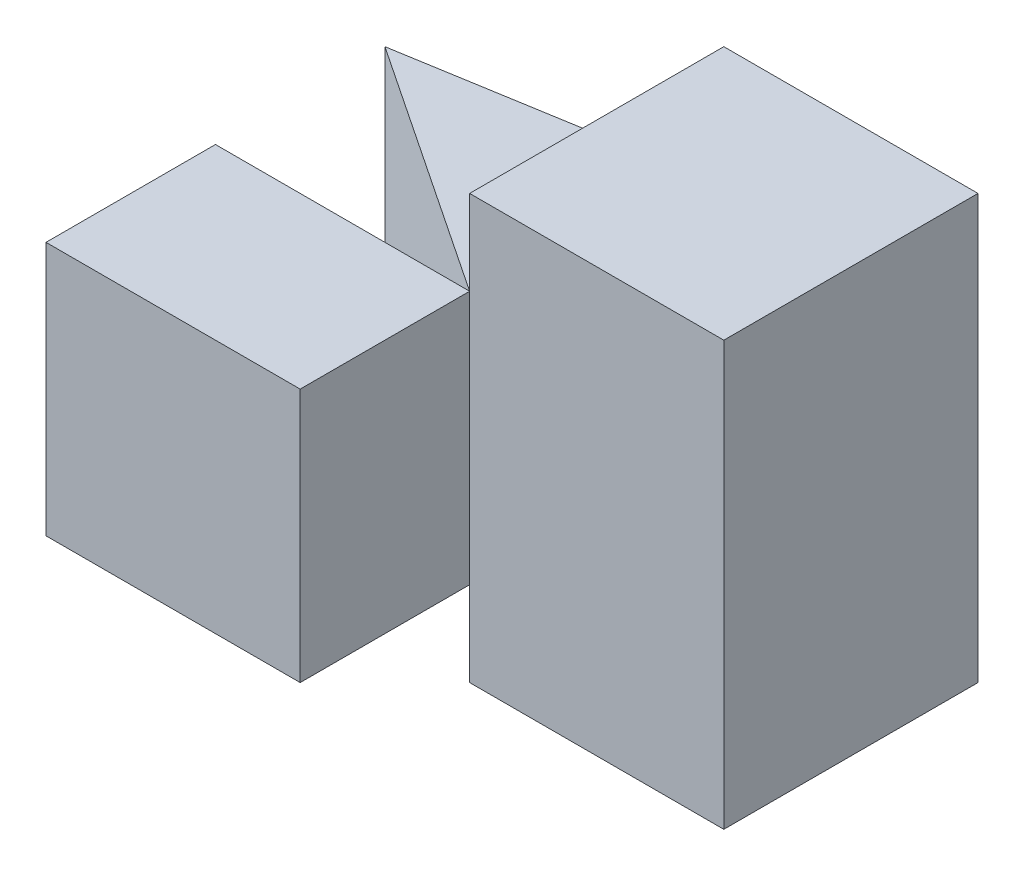
ISO-10303-21;
HEADER;
FILE_DESCRIPTION(('STEP AP214'),'2;1');
FILE_NAME('part.step','',(''),(''),'','','');
FILE_SCHEMA(('AUTOMOTIVE_DESIGN { 1 0 10303 214 1 1 1 1 }'));
ENDSEC;
DATA;
#1=APPLICATION_CONTEXT('core data for automotive mechanical design processes');
#2=APPLICATION_PROTOCOL_DEFINITION('international standard','automotive_design',2000,#1);
#3=PRODUCT_CONTEXT('',#1,'mechanical');
#4=PRODUCT('Part','Part','',(#3));
#5=PRODUCT_RELATED_PRODUCT_CATEGORY('part','',(#4));
#6=PRODUCT_DEFINITION_FORMATION('','',#4);
#7=PRODUCT_DEFINITION_CONTEXT('part definition',#1,'design');
#8=PRODUCT_DEFINITION('design','',#6,#7);
#9=PRODUCT_DEFINITION_SHAPE('','',#8);
#10=(LENGTH_UNIT() NAMED_UNIT(*) SI_UNIT(.MILLI.,.METRE.));
#11=(NAMED_UNIT(*) PLANE_ANGLE_UNIT() SI_UNIT($,.RADIAN.));
#12=(NAMED_UNIT(*) SI_UNIT($,.STERADIAN.) SOLID_ANGLE_UNIT());
#13=UNCERTAINTY_MEASURE_WITH_UNIT(LENGTH_MEASURE(1.E-05),#10,'distance_accuracy_value','');
#14=(GEOMETRIC_REPRESENTATION_CONTEXT(3) GLOBAL_UNCERTAINTY_ASSIGNED_CONTEXT((#13)) GLOBAL_UNIT_ASSIGNED_CONTEXT((#10,
#11,#12)) REPRESENTATION_CONTEXT('',''));
#15=CARTESIAN_POINT('',(0.,0.,0.));
#16=DIRECTION('',(0.,0.,1.));
#17=DIRECTION('',(1.,0.,0.));
#18=AXIS2_PLACEMENT_3D('',#15,#16,#17);
#19=CARTESIAN_POINT('',(0.,5.,-5.));
#20=DIRECTION('',(0.,0.,-1.));
#21=DIRECTION('',(-1.,0.,0.));
#22=AXIS2_PLACEMENT_3D('',#19,#20,#21);
#23=PLANE('',#22);
#24=DIRECTION('',(-1.,0.,0.));
#25=VECTOR('',#24,1.);
#26=CARTESIAN_POINT('',(0.,1.,-5.));
#27=LINE('',#26,#25);
#28=CARTESIAN_POINT('',(6.,1.,-5.));
#29=VERTEX_POINT('',#28);
#30=CARTESIAN_POINT('',(3.,1.,-5.));
#31=VERTEX_POINT('',#30);
#32=EDGE_CURVE('E141',#29,#31,#27,.T.);
#33=ORIENTED_EDGE('',*,*,#32,.F.);
#34=DIRECTION('',(0.,-1.,0.));
#35=VECTOR('',#34,1.);
#36=CARTESIAN_POINT('',(6.,5.,-5.));
#37=LINE('',#36,#35);
#38=CARTESIAN_POINT('',(6.,0.,-5.));
#39=VERTEX_POINT('',#38);
#40=EDGE_CURVE('E80',#29,#39,#37,.T.);
#41=ORIENTED_EDGE('',*,*,#40,.T.);
#42=DIRECTION('',(1.,0.,0.));
#43=VECTOR('',#42,1.);
#44=CARTESIAN_POINT('',(0.,0.,-5.));
#45=LINE('',#44,#43);
#46=CARTESIAN_POINT('',(3.,0.,-5.));
#47=VERTEX_POINT('',#46);
#48=EDGE_CURVE('E174',#47,#39,#45,.T.);
#49=ORIENTED_EDGE('',*,*,#48,.F.);
#50=DIRECTION('',(0.,1.,0.));
#51=VECTOR('',#50,1.);
#52=CARTESIAN_POINT('',(3.,1.,-5.));
#53=LINE('',#52,#51);
#54=EDGE_CURVE('E87',#47,#31,#53,.T.);
#55=ORIENTED_EDGE('',*,*,#54,.T.);
#56=EDGE_LOOP('',(#33,#41,#49,#55));
#57=FACE_BOUND('',#56,.T.);
#58=ADVANCED_FACE('F46',(#57),#23,.T.);
#59=CARTESIAN_POINT('',(3.,1.,-5.));
#60=DIRECTION('',(0.,1.,0.));
#61=DIRECTION('',(0.,0.,1.));
#62=AXIS2_PLACEMENT_3D('',#59,#60,#61);
#63=PLANE('',#62);
#64=DIRECTION('',(-0.986393923832144,0.,0.164398987305357));
#65=VECTOR('',#64,1.);
#66=CARTESIAN_POINT('',(6.,1.,-5.));
#67=LINE('',#66,#65);
#68=CARTESIAN_POINT('',(3.,1.,-4.5));
#69=VERTEX_POINT('',#68);
#70=CARTESIAN_POINT('',(0.,1.,-4.));
#71=VERTEX_POINT('',#70);
#72=EDGE_CURVE('E204',#69,#71,#67,.T.);
#73=ORIENTED_EDGE('',*,*,#72,.F.);
#74=DIRECTION('',(0.,0.,1.));
#75=VECTOR('',#74,1.);
#76=CARTESIAN_POINT('',(3.,1.,-5.));
#77=LINE('',#76,#75);
#78=CARTESIAN_POINT('',(3.,1.,-2.));
#79=VERTEX_POINT('',#78);
#80=EDGE_CURVE('E192',#69,#79,#77,.T.);
#81=ORIENTED_EDGE('',*,*,#80,.T.);
#82=DIRECTION('',(-0.832050294337844,0.,-0.554700196225229));
#83=VECTOR('',#82,1.);
#84=CARTESIAN_POINT('',(1.84615384615385,1.,-2.76923076923077));
#85=LINE('',#84,#83);
#86=EDGE_CURVE('E56',#79,#71,#85,.T.);
#87=ORIENTED_EDGE('',*,*,#86,.T.);
#88=EDGE_LOOP('',(#73,#81,#87));
#89=FACE_BOUND('',#88,.T.);
#90=ADVANCED_FACE('F221',(#89),#63,.F.);
#91=CARTESIAN_POINT('',(0.,4.,-5.));
#92=DIRECTION('',(0.,-1.,0.));
#93=DIRECTION('',(0.,0.,-1.));
#94=AXIS2_PLACEMENT_3D('',#91,#92,#93);
#95=PLANE('',#94);
#96=DIRECTION('',(0.986393923832144,0.,-0.164398987305357));
#97=VECTOR('',#96,1.);
#98=CARTESIAN_POINT('',(0.,4.,-4.));
#99=LINE('',#98,#97);
#100=CARTESIAN_POINT('',(0.,4.,-4.));
#101=VERTEX_POINT('',#100);
#102=CARTESIAN_POINT('',(3.,4.,-4.5));
#103=VERTEX_POINT('',#102);
#104=EDGE_CURVE('E142',#101,#103,#99,.T.);
#105=ORIENTED_EDGE('',*,*,#104,.F.);
#106=DIRECTION('',(0.832050294337844,0.,0.554700196225229));
#107=VECTOR('',#106,1.);
#108=CARTESIAN_POINT('',(1.84615384615385,4.,-2.76923076923077));
#109=LINE('',#108,#107);
#110=CARTESIAN_POINT('',(3.,4.,-2.));
#111=VERTEX_POINT('',#110);
#112=EDGE_CURVE('E13',#101,#111,#109,.T.);
#113=ORIENTED_EDGE('',*,*,#112,.T.);
#114=DIRECTION('',(0.,0.,1.));
#115=VECTOR('',#114,1.);
#116=CARTESIAN_POINT('',(3.,4.,-5.));
#117=LINE('',#116,#115);
#118=EDGE_CURVE('E194',#103,#111,#117,.T.);
#119=ORIENTED_EDGE('',*,*,#118,.F.);
#120=EDGE_LOOP('',(#105,#113,#119));
#121=FACE_BOUND('',#120,.T.);
#122=ADVANCED_FACE('F243',(#121),#95,.F.);
#123=CARTESIAN_POINT('',(1.84615384615385,5.,-2.76923076923077));
#124=DIRECTION('',(-0.554700196225229,0.,0.832050294337844));
#125=DIRECTION('',(0.832050294337844,0.,0.554700196225229));
#126=AXIS2_PLACEMENT_3D('',#123,#124,#125);
#127=PLANE('',#126);
#128=ORIENTED_EDGE('',*,*,#112,.F.);
#129=DIRECTION('',(0.,-1.,0.));
#130=VECTOR('',#129,1.);
#131=CARTESIAN_POINT('',(0.,5.,-4.));
#132=LINE('',#131,#130);
#133=EDGE_CURVE('E217',#101,#71,#132,.T.);
#134=ORIENTED_EDGE('',*,*,#133,.T.);
#135=ORIENTED_EDGE('',*,*,#86,.F.);
#136=DIRECTION('',(0.,-1.,0.));
#137=VECTOR('',#136,1.);
#138=CARTESIAN_POINT('',(3.,5.,-2.));
#139=LINE('',#138,#137);
#140=EDGE_CURVE('E164',#111,#79,#139,.T.);
#141=ORIENTED_EDGE('',*,*,#140,.F.);
#142=EDGE_LOOP('',(#128,#134,#135,#141));
#143=FACE_BOUND('',#142,.T.);
#144=ADVANCED_FACE('F48',(#143),#127,.T.);
#145=CARTESIAN_POINT('',(0.,5.,-2.));
#146=DIRECTION('',(0.,0.,-1.));
#147=DIRECTION('',(-1.,0.,0.));
#148=AXIS2_PLACEMENT_3D('',#145,#146,#147);
#149=PLANE('',#148);
#150=DIRECTION('',(1.,0.,0.));
#151=VECTOR('',#150,1.);
#152=CARTESIAN_POINT('',(0.,0.,-2.));
#153=LINE('',#152,#151);
#154=CARTESIAN_POINT('',(3.,0.,-2.));
#155=VERTEX_POINT('',#154);
#156=CARTESIAN_POINT('',(6.,0.,-2.));
#157=VERTEX_POINT('',#156);
#158=EDGE_CURVE('E180',#155,#157,#153,.T.);
#159=ORIENTED_EDGE('',*,*,#158,.T.);
#160=DIRECTION('',(0.,-1.,0.));
#161=VECTOR('',#160,1.);
#162=CARTESIAN_POINT('',(6.,5.,-2.));
#163=LINE('',#162,#161);
#164=CARTESIAN_POINT('',(6.,5.,-2.));
#165=VERTEX_POINT('',#164);
#166=EDGE_CURVE('E161',#165,#157,#163,.T.);
#167=ORIENTED_EDGE('',*,*,#166,.F.);
#168=DIRECTION('',(1.,0.,0.));
#169=VECTOR('',#168,1.);
#170=CARTESIAN_POINT('',(0.,5.,-2.));
#171=LINE('',#170,#169);
#172=CARTESIAN_POINT('',(3.,5.,-2.));
#173=VERTEX_POINT('',#172);
#174=EDGE_CURVE('E177',#173,#165,#171,.T.);
#175=ORIENTED_EDGE('',*,*,#174,.F.);
#176=EDGE_CURVE('E94',#173,#111,#139,.T.);
#177=ORIENTED_EDGE('',*,*,#176,.T.);
#178=ORIENTED_EDGE('',*,*,#140,.T.);
#179=DIRECTION('',(0.,-1.,0.));
#180=VECTOR('',#179,1.);
#181=CARTESIAN_POINT('',(3.,5.,-2.));
#182=LINE('',#181,#180);
#183=EDGE_CURVE('E182',#79,#155,#182,.T.);
#184=ORIENTED_EDGE('',*,*,#183,.T.);
#185=EDGE_LOOP('',(#159,#167,#175,#177,#178,#184));
#186=FACE_BOUND('',#185,.T.);
#187=ADVANCED_FACE('F234',(#186),#149,.F.);
#188=CARTESIAN_POINT('',(6.,5.,0.));
#189=DIRECTION('',(-1.,0.,0.));
#190=DIRECTION('',(0.,0.,1.));
#191=AXIS2_PLACEMENT_3D('',#188,#189,#190);
#192=PLANE('',#191);
#193=DIRECTION('',(0.,0.,-1.));
#194=VECTOR('',#193,1.);
#195=CARTESIAN_POINT('',(6.,0.,0.));
#196=LINE('',#195,#194);
#197=EDGE_CURVE('E178',#157,#39,#196,.T.);
#198=ORIENTED_EDGE('',*,*,#197,.T.);
#199=ORIENTED_EDGE('',*,*,#40,.F.);
#200=DIRECTION('',(0.,-1.,0.));
#201=VECTOR('',#200,1.);
#202=CARTESIAN_POINT('',(6.,4.,-5.));
#203=LINE('',#202,#201);
#204=CARTESIAN_POINT('',(6.,4.,-5.));
#205=VERTEX_POINT('',#204);
#206=EDGE_CURVE('E149',#205,#29,#203,.T.);
#207=ORIENTED_EDGE('',*,*,#206,.F.);
#208=CARTESIAN_POINT('',(6.,5.,-5.));
#209=VERTEX_POINT('',#208);
#210=EDGE_CURVE('E155',#209,#205,#37,.T.);
#211=ORIENTED_EDGE('',*,*,#210,.F.);
#212=DIRECTION('',(0.,0.,-1.));
#213=VECTOR('',#212,1.);
#214=CARTESIAN_POINT('',(6.,5.,0.));
#215=LINE('',#214,#213);
#216=EDGE_CURVE('E65',#165,#209,#215,.T.);
#217=ORIENTED_EDGE('',*,*,#216,.F.);
#218=ORIENTED_EDGE('',*,*,#166,.T.);
#219=EDGE_LOOP('',(#198,#199,#207,#211,#217,#218));
#220=FACE_BOUND('',#219,.T.);
#221=ADVANCED_FACE('F154',(#220),#192,.F.);
#222=DIRECTION('',(1.,0.,0.));
#223=VECTOR('',#222,1.);
#224=CARTESIAN_POINT('',(0.,4.,-5.));
#225=LINE('',#224,#223);
#226=CARTESIAN_POINT('',(3.,4.,-5.));
#227=VERTEX_POINT('',#226);
#228=EDGE_CURVE('E130',#227,#205,#225,.T.);
#229=ORIENTED_EDGE('',*,*,#228,.F.);
#230=DIRECTION('',(0.,-1.,0.));
#231=VECTOR('',#230,1.);
#232=CARTESIAN_POINT('',(3.,5.,-5.));
#233=LINE('',#232,#231);
#234=CARTESIAN_POINT('',(3.,5.,-5.));
#235=VERTEX_POINT('',#234);
#236=EDGE_CURVE('E166',#235,#227,#233,.T.);
#237=ORIENTED_EDGE('',*,*,#236,.F.);
#238=DIRECTION('',(1.,0.,0.));
#239=VECTOR('',#238,1.);
#240=CARTESIAN_POINT('',(0.,5.,-5.));
#241=LINE('',#240,#239);
#242=EDGE_CURVE('E160',#235,#209,#241,.T.);
#243=ORIENTED_EDGE('',*,*,#242,.T.);
#244=ORIENTED_EDGE('',*,*,#210,.T.);
#245=EDGE_LOOP('',(#229,#237,#243,#244));
#246=FACE_BOUND('',#245,.T.);
#247=ADVANCED_FACE('F159',(#246),#23,.T.);
#248=CARTESIAN_POINT('',(0.,5.,0.));
#249=DIRECTION('',(0.,1.,0.));
#250=DIRECTION('',(0.,0.,1.));
#251=AXIS2_PLACEMENT_3D('',#248,#249,#250);
#252=PLANE('',#251);
#253=DIRECTION('',(0.,0.,1.));
#254=VECTOR('',#253,1.);
#255=CARTESIAN_POINT('',(3.,5.,-5.));
#256=LINE('',#255,#254);
#257=EDGE_CURVE('E188',#235,#173,#256,.T.);
#258=ORIENTED_EDGE('',*,*,#257,.T.);
#259=ORIENTED_EDGE('',*,*,#174,.T.);
#260=ORIENTED_EDGE('',*,*,#216,.T.);
#261=ORIENTED_EDGE('',*,*,#242,.F.);
#262=EDGE_LOOP('',(#258,#259,#260,#261));
#263=FACE_BOUND('',#262,.T.);
#264=ADVANCED_FACE('F240',(#263),#252,.T.);
#265=CARTESIAN_POINT('',(0.,0.,0.));
#266=DIRECTION('',(0.,1.,0.));
#267=DIRECTION('',(0.,0.,1.));
#268=AXIS2_PLACEMENT_3D('',#265,#266,#267);
#269=PLANE('',#268);
#270=ORIENTED_EDGE('',*,*,#158,.F.);
#271=DIRECTION('',(0.,0.,1.));
#272=VECTOR('',#271,1.);
#273=CARTESIAN_POINT('',(3.,0.,-5.));
#274=LINE('',#273,#272);
#275=EDGE_CURVE('E191',#47,#155,#274,.T.);
#276=ORIENTED_EDGE('',*,*,#275,.F.);
#277=ORIENTED_EDGE('',*,*,#48,.T.);
#278=ORIENTED_EDGE('',*,*,#197,.F.);
#279=EDGE_LOOP('',(#270,#276,#277,#278));
#280=FACE_BOUND('',#279,.T.);
#281=ADVANCED_FACE('F239',(#280),#269,.F.);
#282=CARTESIAN_POINT('',(3.,1.,-5.));
#283=DIRECTION('',(1.,0.,0.));
#284=DIRECTION('',(0.,0.,-1.));
#285=AXIS2_PLACEMENT_3D('',#282,#283,#284);
#286=PLANE('',#285);
#287=EDGE_CURVE('E189',#31,#69,#77,.T.);
#288=ORIENTED_EDGE('',*,*,#287,.F.);
#289=ORIENTED_EDGE('',*,*,#54,.F.);
#290=ORIENTED_EDGE('',*,*,#275,.T.);
#291=ORIENTED_EDGE('',*,*,#183,.F.);
#292=ORIENTED_EDGE('',*,*,#80,.F.);
#293=EDGE_LOOP('',(#288,#289,#290,#291,#292));
#294=FACE_BOUND('',#293,.T.);
#295=ADVANCED_FACE('F291',(#294),#286,.F.);
#296=CARTESIAN_POINT('',(3.,5.,-5.));
#297=DIRECTION('',(1.,0.,0.));
#298=DIRECTION('',(0.,0.,-1.));
#299=AXIS2_PLACEMENT_3D('',#296,#297,#298);
#300=PLANE('',#299);
#301=ORIENTED_EDGE('',*,*,#257,.F.);
#302=ORIENTED_EDGE('',*,*,#236,.T.);
#303=EDGE_CURVE('E136',#227,#103,#117,.T.);
#304=ORIENTED_EDGE('',*,*,#303,.T.);
#305=ORIENTED_EDGE('',*,*,#118,.T.);
#306=ORIENTED_EDGE('',*,*,#176,.F.);
#307=EDGE_LOOP('',(#301,#302,#304,#305,#306));
#308=FACE_BOUND('',#307,.T.);
#309=ADVANCED_FACE('F241',(#308),#300,.F.);
#310=CARTESIAN_POINT('',(-0.648648648648649,0.,-3.89189189189189));
#311=DIRECTION('',(-0.164398987305357,0.,-0.986393923832144));
#312=DIRECTION('',(-0.986393923832144,0.,0.164398987305357));
#313=AXIS2_PLACEMENT_3D('',#310,#311,#312);
#314=PLANE('',#313);
#315=EDGE_CURVE('E157',#29,#69,#67,.T.);
#316=ORIENTED_EDGE('',*,*,#315,.T.);
#317=ORIENTED_EDGE('',*,*,#72,.T.);
#318=ORIENTED_EDGE('',*,*,#133,.F.);
#319=ORIENTED_EDGE('',*,*,#104,.T.);
#320=EDGE_CURVE('E133',#103,#205,#99,.T.);
#321=ORIENTED_EDGE('',*,*,#320,.T.);
#322=ORIENTED_EDGE('',*,*,#206,.T.);
#323=EDGE_LOOP('',(#316,#317,#318,#319,#321,#322));
#324=FACE_BOUND('',#323,.T.);
#325=ADVANCED_FACE('F148',(#324),#314,.T.);
#326=CARTESIAN_POINT('',(6.,1.,-5.));
#327=DIRECTION('',(0.,-1.,0.));
#328=DIRECTION('',(0.,0.,-1.));
#329=AXIS2_PLACEMENT_3D('',#326,#327,#328);
#330=PLANE('',#329);
#331=ORIENTED_EDGE('',*,*,#32,.T.);
#332=ORIENTED_EDGE('',*,*,#287,.T.);
#333=ORIENTED_EDGE('',*,*,#315,.F.);
#334=EDGE_LOOP('',(#331,#332,#333));
#335=FACE_BOUND('',#334,.T.);
#336=ADVANCED_FACE('F313',(#335),#330,.F.);
#337=CARTESIAN_POINT('',(0.,4.,-4.));
#338=DIRECTION('',(0.,1.,0.));
#339=DIRECTION('',(0.,0.,1.));
#340=AXIS2_PLACEMENT_3D('',#337,#338,#339);
#341=PLANE('',#340);
#342=ORIENTED_EDGE('',*,*,#228,.T.);
#343=ORIENTED_EDGE('',*,*,#320,.F.);
#344=ORIENTED_EDGE('',*,*,#303,.F.);
#345=EDGE_LOOP('',(#342,#343,#344));
#346=FACE_BOUND('',#345,.T.);
#347=ADVANCED_FACE('F132',(#346),#341,.F.);
#348=CLOSED_SHELL('',(#58,#90,#122,#144,#187,#221,#247,#264,#281,#295,#309,#325,#336,#347));
#349=MANIFOLD_SOLID_BREP('B2',#348);
#350=CARTESIAN_POINT('',(0.,5.,0.));
#351=DIRECTION('',(0.,0.,-1.));
#352=DIRECTION('',(-1.,0.,0.));
#353=AXIS2_PLACEMENT_3D('',#350,#351,#352);
#354=PLANE('',#353);
#355=DIRECTION('',(0.,-1.,0.));
#356=VECTOR('',#355,1.);
#357=CARTESIAN_POINT('',(3.,5.,0.));
#358=LINE('',#357,#356);
#359=CARTESIAN_POINT('',(3.,4.,0.));
#360=VERTEX_POINT('',#359);
#361=CARTESIAN_POINT('',(3.,1.,0.));
#362=VERTEX_POINT('',#361);
#363=EDGE_CURVE('E44',#360,#362,#358,.T.);
#364=ORIENTED_EDGE('',*,*,#363,.F.);
#365=DIRECTION('',(1.,0.,0.));
#366=VECTOR('',#365,1.);
#367=CARTESIAN_POINT('',(0.,4.,0.));
#368=LINE('',#367,#366);
#369=CARTESIAN_POINT('',(0.,4.,0.));
#370=VERTEX_POINT('',#369);
#371=EDGE_CURVE('E405',#370,#360,#368,.T.);
#372=ORIENTED_EDGE('',*,*,#371,.F.);
#373=DIRECTION('',(0.,-1.,0.));
#374=VECTOR('',#373,1.);
#375=CARTESIAN_POINT('',(0.,5.,0.));
#376=LINE('',#375,#374);
#377=CARTESIAN_POINT('',(0.,1.,0.));
#378=VERTEX_POINT('',#377);
#379=EDGE_CURVE('E416',#370,#378,#376,.T.);
#380=ORIENTED_EDGE('',*,*,#379,.T.);
#381=DIRECTION('',(-1.,0.,0.));
#382=VECTOR('',#381,1.);
#383=CARTESIAN_POINT('',(3.,1.,0.));
#384=LINE('',#383,#382);
#385=EDGE_CURVE('E387',#362,#378,#384,.T.);
#386=ORIENTED_EDGE('',*,*,#385,.F.);
#387=EDGE_LOOP('',(#364,#372,#380,#386));
#388=FACE_BOUND('',#387,.T.);
#389=ADVANCED_FACE('F365',(#388),#354,.F.);
#390=CARTESIAN_POINT('',(3.,5.,0.));
#391=DIRECTION('',(-1.,0.,0.));
#392=DIRECTION('',(0.,0.,1.));
#393=AXIS2_PLACEMENT_3D('',#390,#391,#392);
#394=PLANE('',#393);
#395=DIRECTION('',(0.,-1.,0.));
#396=VECTOR('',#395,1.);
#397=CARTESIAN_POINT('',(3.,5.,-2.));
#398=LINE('',#397,#396);
#399=CARTESIAN_POINT('',(3.,4.,-2.));
#400=VERTEX_POINT('',#399);
#401=CARTESIAN_POINT('',(3.,1.,-2.));
#402=VERTEX_POINT('',#401);
#403=EDGE_CURVE('E372',#400,#402,#398,.T.);
#404=ORIENTED_EDGE('',*,*,#403,.F.);
#405=DIRECTION('',(0.,0.,1.));
#406=VECTOR('',#405,1.);
#407=CARTESIAN_POINT('',(3.,4.,-5.));
#408=LINE('',#407,#406);
#409=EDGE_CURVE('E411',#400,#360,#408,.T.);
#410=ORIENTED_EDGE('',*,*,#409,.T.);
#411=ORIENTED_EDGE('',*,*,#363,.T.);
#412=DIRECTION('',(0.,0.,1.));
#413=VECTOR('',#412,1.);
#414=CARTESIAN_POINT('',(3.,1.,-5.));
#415=LINE('',#414,#413);
#416=EDGE_CURVE('E434',#402,#362,#415,.T.);
#417=ORIENTED_EDGE('',*,*,#416,.F.);
#418=EDGE_LOOP('',(#404,#410,#411,#417));
#419=FACE_BOUND('',#418,.T.);
#420=ADVANCED_FACE('F433',(#419),#394,.F.);
#421=CARTESIAN_POINT('',(0.,5.,-2.));
#422=DIRECTION('',(0.,0.,-1.));
#423=DIRECTION('',(-1.,0.,0.));
#424=AXIS2_PLACEMENT_3D('',#421,#422,#423);
#425=PLANE('',#424);
#426=DIRECTION('',(-1.,0.,0.));
#427=VECTOR('',#426,1.);
#428=CARTESIAN_POINT('',(0.,4.,-2.));
#429=LINE('',#428,#427);
#430=CARTESIAN_POINT('',(0.,4.,-2.));
#431=VERTEX_POINT('',#430);
#432=EDGE_CURVE('E379',#400,#431,#429,.T.);
#433=ORIENTED_EDGE('',*,*,#432,.F.);
#434=ORIENTED_EDGE('',*,*,#403,.T.);
#435=DIRECTION('',(1.,0.,0.));
#436=VECTOR('',#435,1.);
#437=CARTESIAN_POINT('',(0.,1.,-2.));
#438=LINE('',#437,#436);
#439=CARTESIAN_POINT('',(0.,1.,-2.));
#440=VERTEX_POINT('',#439);
#441=EDGE_CURVE('E423',#440,#402,#438,.T.);
#442=ORIENTED_EDGE('',*,*,#441,.F.);
#443=DIRECTION('',(0.,-1.,0.));
#444=VECTOR('',#443,1.);
#445=CARTESIAN_POINT('',(0.,5.,-2.));
#446=LINE('',#445,#444);
#447=EDGE_CURVE('E420',#431,#440,#446,.T.);
#448=ORIENTED_EDGE('',*,*,#447,.F.);
#449=EDGE_LOOP('',(#433,#434,#442,#448));
#450=FACE_BOUND('',#449,.T.);
#451=ADVANCED_FACE('F430',(#450),#425,.T.);
#452=CARTESIAN_POINT('',(0.,5.,0.));
#453=DIRECTION('',(-1.,0.,0.));
#454=DIRECTION('',(0.,0.,1.));
#455=AXIS2_PLACEMENT_3D('',#452,#453,#454);
#456=PLANE('',#455);
#457=DIRECTION('',(0.,0.,1.));
#458=VECTOR('',#457,1.);
#459=CARTESIAN_POINT('',(0.,4.,-5.));
#460=LINE('',#459,#458);
#461=EDGE_CURVE('E402',#431,#370,#460,.T.);
#462=ORIENTED_EDGE('',*,*,#461,.F.);
#463=ORIENTED_EDGE('',*,*,#447,.T.);
#464=DIRECTION('',(0.,0.,1.));
#465=VECTOR('',#464,1.);
#466=CARTESIAN_POINT('',(0.,1.,-5.));
#467=LINE('',#466,#465);
#468=EDGE_CURVE('E417',#440,#378,#467,.T.);
#469=ORIENTED_EDGE('',*,*,#468,.T.);
#470=ORIENTED_EDGE('',*,*,#379,.F.);
#471=EDGE_LOOP('',(#462,#463,#469,#470));
#472=FACE_BOUND('',#471,.T.);
#473=ADVANCED_FACE('F419',(#472),#456,.T.);
#474=CARTESIAN_POINT('',(3.,1.,-5.));
#475=DIRECTION('',(0.,1.,0.));
#476=DIRECTION('',(0.,0.,1.));
#477=AXIS2_PLACEMENT_3D('',#474,#475,#476);
#478=PLANE('',#477);
#479=ORIENTED_EDGE('',*,*,#441,.T.);
#480=ORIENTED_EDGE('',*,*,#416,.T.);
#481=ORIENTED_EDGE('',*,*,#385,.T.);
#482=ORIENTED_EDGE('',*,*,#468,.F.);
#483=EDGE_LOOP('',(#479,#480,#481,#482));
#484=FACE_BOUND('',#483,.T.);
#485=ADVANCED_FACE('F439',(#484),#478,.F.);
#486=CARTESIAN_POINT('',(0.,4.,-5.));
#487=DIRECTION('',(0.,-1.,0.));
#488=DIRECTION('',(0.,0.,-1.));
#489=AXIS2_PLACEMENT_3D('',#486,#487,#488);
#490=PLANE('',#489);
#491=ORIENTED_EDGE('',*,*,#432,.T.);
#492=ORIENTED_EDGE('',*,*,#461,.T.);
#493=ORIENTED_EDGE('',*,*,#371,.T.);
#494=ORIENTED_EDGE('',*,*,#409,.F.);
#495=EDGE_LOOP('',(#491,#492,#493,#494));
#496=FACE_BOUND('',#495,.T.);
#497=ADVANCED_FACE('F404',(#496),#490,.F.);
#498=CLOSED_SHELL('',(#389,#420,#451,#473,#485,#497));
#499=MANIFOLD_SOLID_BREP('B7',#498);
#500=ADVANCED_BREP_SHAPE_REPRESENTATION('',(#18,#349,#499),#14);
#501=SHAPE_DEFINITION_REPRESENTATION(#9,#500);
ENDSEC;
END-ISO-10303-21;
